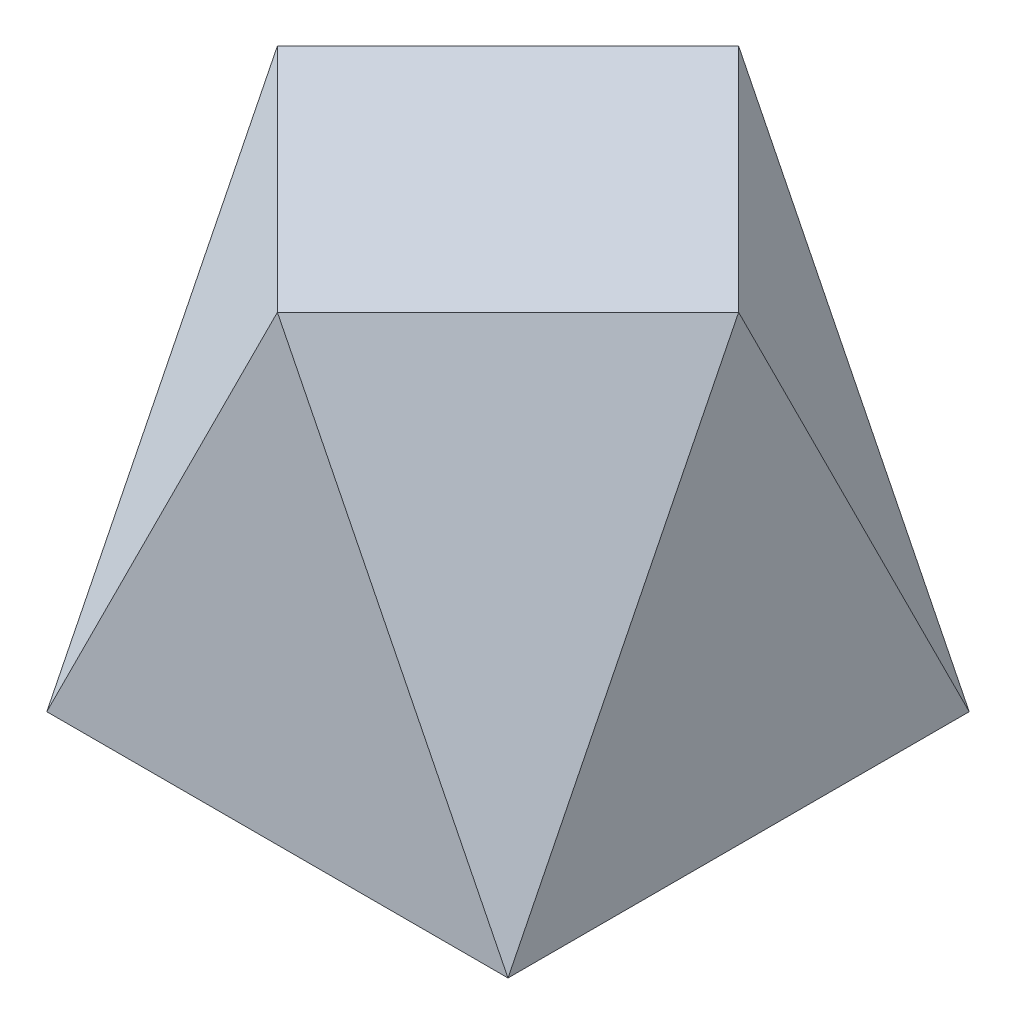
ISO-10303-21;
HEADER;
FILE_DESCRIPTION(('STEP AP214'),'2;1');
FILE_NAME('part.step','',(''),(''),'','','');
FILE_SCHEMA(('AUTOMOTIVE_DESIGN { 1 0 10303 214 1 1 1 1 }'));
ENDSEC;
DATA;
#1=APPLICATION_CONTEXT('core data for automotive mechanical design processes');
#2=APPLICATION_PROTOCOL_DEFINITION('international standard','automotive_design',2000,#1);
#3=PRODUCT_CONTEXT('',#1,'mechanical');
#4=PRODUCT('Part','Part','',(#3));
#5=PRODUCT_RELATED_PRODUCT_CATEGORY('part','',(#4));
#6=PRODUCT_DEFINITION_FORMATION('','',#4);
#7=PRODUCT_DEFINITION_CONTEXT('part definition',#1,'design');
#8=PRODUCT_DEFINITION('design','',#6,#7);
#9=PRODUCT_DEFINITION_SHAPE('','',#8);
#10=(LENGTH_UNIT() NAMED_UNIT(*) SI_UNIT(.MILLI.,.METRE.));
#11=(NAMED_UNIT(*) PLANE_ANGLE_UNIT() SI_UNIT($,.RADIAN.));
#12=(NAMED_UNIT(*) SI_UNIT($,.STERADIAN.) SOLID_ANGLE_UNIT());
#13=UNCERTAINTY_MEASURE_WITH_UNIT(LENGTH_MEASURE(1.E-05),#10,'distance_accuracy_value','');
#14=(GEOMETRIC_REPRESENTATION_CONTEXT(3) GLOBAL_UNCERTAINTY_ASSIGNED_CONTEXT((#13)) GLOBAL_UNIT_ASSIGNED_CONTEXT((#10,
#11,#12)) REPRESENTATION_CONTEXT('',''));
#15=CARTESIAN_POINT('',(0.,0.,0.));
#16=DIRECTION('',(0.,0.,1.));
#17=DIRECTION('',(1.,0.,0.));
#18=AXIS2_PLACEMENT_3D('',#15,#16,#17);
#19=CARTESIAN_POINT('',(-2.,4.,-2.));
#20=DIRECTION('',(0.,0.,1.));
#21=DIRECTION('',(1.,0.,0.));
#22=AXIS2_PLACEMENT_3D('',#19,#20,#21);
#23=PLANE('',#22);
#24=DIRECTION('',(-0.45428866888855,-0.890854536565577,0.));
#25=VECTOR('',#24,1.);
#26=CARTESIAN_POINT('',(0.,4.,-2.));
#27=LINE('',#26,#25);
#28=CARTESIAN_POINT('',(0.,4.,-2.));
#29=VERTEX_POINT('',#28);
#30=CARTESIAN_POINT('',(-2.,0.0780244035356792,-2.));
#31=VERTEX_POINT('',#30);
#32=EDGE_CURVE('E53',#29,#31,#27,.T.);
#33=ORIENTED_EDGE('',*,*,#32,.F.);
#34=DIRECTION('',(0.447213595499958,-0.894427190999916,0.));
#35=VECTOR('',#34,1.);
#36=CARTESIAN_POINT('',(0.,4.,-2.));
#37=LINE('',#36,#35);
#38=CARTESIAN_POINT('',(2.,0.,-2.));
#39=VERTEX_POINT('',#38);
#40=EDGE_CURVE('E94',#29,#39,#37,.T.);
#41=ORIENTED_EDGE('',*,*,#40,.T.);
#42=DIRECTION('',(-1.,0.,0.));
#43=VECTOR('',#42,1.);
#44=CARTESIAN_POINT('',(-2.,0.,-2.));
#45=LINE('',#44,#43);
#46=CARTESIAN_POINT('',(-2.,0.,-2.));
#47=VERTEX_POINT('',#46);
#48=EDGE_CURVE('E144',#39,#47,#45,.T.);
#49=ORIENTED_EDGE('',*,*,#48,.T.);
#50=DIRECTION('',(0.,-1.,0.));
#51=VECTOR('',#50,1.);
#52=CARTESIAN_POINT('',(-2.,4.,-2.));
#53=LINE('',#52,#51);
#54=EDGE_CURVE('E12',#31,#47,#53,.T.);
#55=ORIENTED_EDGE('',*,*,#54,.F.);
#56=EDGE_LOOP('',(#33,#41,#49,#55));
#57=FACE_BOUND('',#56,.T.);
#58=ADVANCED_FACE('F37',(#57),#23,.F.);
#59=CARTESIAN_POINT('',(0.,4.,0.));
#60=DIRECTION('',(0.,-1.,0.));
#61=DIRECTION('',(0.,0.,-1.));
#62=AXIS2_PLACEMENT_3D('',#59,#60,#61);
#63=PLANE('',#62);
#64=DIRECTION('',(0.707106781186547,0.,-0.707106781186548));
#65=VECTOR('',#64,1.);
#66=CARTESIAN_POINT('',(-2.,4.,0.));
#67=LINE('',#66,#65);
#68=CARTESIAN_POINT('',(-2.,4.,0.));
#69=VERTEX_POINT('',#68);
#70=EDGE_CURVE('E80',#69,#29,#67,.T.);
#71=ORIENTED_EDGE('',*,*,#70,.F.);
#72=DIRECTION('',(-0.707106781186548,0.,-0.707106781186548));
#73=VECTOR('',#72,1.);
#74=CARTESIAN_POINT('',(0.,4.,2.));
#75=LINE('',#74,#73);
#76=CARTESIAN_POINT('',(0.,4.,2.));
#77=VERTEX_POINT('',#76);
#78=EDGE_CURVE('E117',#77,#69,#75,.T.);
#79=ORIENTED_EDGE('',*,*,#78,.F.);
#80=DIRECTION('',(0.707106781186548,0.,-0.707106781186548));
#81=VECTOR('',#80,1.);
#82=CARTESIAN_POINT('',(0.,4.,2.));
#83=LINE('',#82,#81);
#84=CARTESIAN_POINT('',(2.,4.,0.));
#85=VERTEX_POINT('',#84);
#86=EDGE_CURVE('E101',#77,#85,#83,.T.);
#87=ORIENTED_EDGE('',*,*,#86,.T.);
#88=DIRECTION('',(-0.707106781186548,0.,-0.707106781186548));
#89=VECTOR('',#88,1.);
#90=CARTESIAN_POINT('',(2.,4.,0.));
#91=LINE('',#90,#89);
#92=EDGE_CURVE('E87',#85,#29,#91,.T.);
#93=ORIENTED_EDGE('',*,*,#92,.T.);
#94=EDGE_LOOP('',(#71,#79,#87,#93));
#95=FACE_BOUND('',#94,.T.);
#96=ADVANCED_FACE('F104',(#95),#63,.F.);
#97=CARTESIAN_POINT('',(-2.,4.,2.));
#98=DIRECTION('',(0.,0.,-1.));
#99=DIRECTION('',(-1.,0.,0.));
#100=AXIS2_PLACEMENT_3D('',#97,#98,#99);
#101=PLANE('',#100);
#102=DIRECTION('',(1.,0.,0.));
#103=VECTOR('',#102,1.);
#104=CARTESIAN_POINT('',(-2.,0.,2.));
#105=LINE('',#104,#103);
#106=CARTESIAN_POINT('',(-2.,0.,2.));
#107=VERTEX_POINT('',#106);
#108=CARTESIAN_POINT('',(2.,0.,2.));
#109=VERTEX_POINT('',#108);
#110=EDGE_CURVE('E46',#107,#109,#105,.T.);
#111=ORIENTED_EDGE('',*,*,#110,.T.);
#112=DIRECTION('',(0.447213595499958,-0.894427190999916,0.));
#113=VECTOR('',#112,1.);
#114=CARTESIAN_POINT('',(0.,4.,2.));
#115=LINE('',#114,#113);
#116=EDGE_CURVE('E61',#77,#109,#115,.T.);
#117=ORIENTED_EDGE('',*,*,#116,.F.);
#118=DIRECTION('',(0.447213595499958,0.894427190999916,0.));
#119=VECTOR('',#118,1.);
#120=CARTESIAN_POINT('',(-2.,0.,2.));
#121=LINE('',#120,#119);
#122=EDGE_CURVE('E128',#107,#77,#121,.T.);
#123=ORIENTED_EDGE('',*,*,#122,.F.);
#124=EDGE_LOOP('',(#111,#117,#123));
#125=FACE_BOUND('',#124,.T.);
#126=ADVANCED_FACE('F173',(#125),#101,.F.);
#127=CARTESIAN_POINT('',(2.,4.,2.));
#128=DIRECTION('',(-1.,0.,0.));
#129=DIRECTION('',(0.,0.,1.));
#130=AXIS2_PLACEMENT_3D('',#127,#128,#129);
#131=PLANE('',#130);
#132=DIRECTION('',(0.,0.,-1.));
#133=VECTOR('',#132,1.);
#134=CARTESIAN_POINT('',(2.,0.,2.));
#135=LINE('',#134,#133);
#136=EDGE_CURVE('E133',#109,#39,#135,.T.);
#137=ORIENTED_EDGE('',*,*,#136,.T.);
#138=DIRECTION('',(0.,0.894427190999916,0.447213595499958));
#139=VECTOR('',#138,1.);
#140=CARTESIAN_POINT('',(2.,0.,-2.));
#141=LINE('',#140,#139);
#142=EDGE_CURVE('E100',#39,#85,#141,.T.);
#143=ORIENTED_EDGE('',*,*,#142,.T.);
#144=DIRECTION('',(0.,0.894427190999916,-0.447213595499958));
#145=VECTOR('',#144,1.);
#146=CARTESIAN_POINT('',(2.,0.,2.));
#147=LINE('',#146,#145);
#148=EDGE_CURVE('E118',#109,#85,#147,.T.);
#149=ORIENTED_EDGE('',*,*,#148,.F.);
#150=EDGE_LOOP('',(#137,#143,#149));
#151=FACE_BOUND('',#150,.T.);
#152=ADVANCED_FACE('F39',(#151),#131,.F.);
#153=CARTESIAN_POINT('',(-2.,4.,2.));
#154=DIRECTION('',(1.,0.,0.));
#155=DIRECTION('',(0.,0.,-1.));
#156=AXIS2_PLACEMENT_3D('',#153,#154,#155);
#157=PLANE('',#156);
#158=DIRECTION('',(0.,-0.894427190999916,0.447213595499958));
#159=VECTOR('',#158,1.);
#160=CARTESIAN_POINT('',(-2.,4.,0.));
#161=LINE('',#160,#159);
#162=EDGE_CURVE('E131',#69,#107,#161,.T.);
#163=ORIENTED_EDGE('',*,*,#162,.F.);
#164=DIRECTION('',(0.,0.890854536565577,0.45428866888855));
#165=VECTOR('',#164,1.);
#166=CARTESIAN_POINT('',(-2.,0.0780244035356792,-2.));
#167=LINE('',#166,#165);
#168=EDGE_CURVE('E82',#31,#69,#167,.T.);
#169=ORIENTED_EDGE('',*,*,#168,.F.);
#170=ORIENTED_EDGE('',*,*,#54,.T.);
#171=DIRECTION('',(0.,0.,1.));
#172=VECTOR('',#171,1.);
#173=CARTESIAN_POINT('',(-2.,0.,2.));
#174=LINE('',#173,#172);
#175=EDGE_CURVE('E141',#47,#107,#174,.T.);
#176=ORIENTED_EDGE('',*,*,#175,.T.);
#177=EDGE_LOOP('',(#163,#169,#170,#176));
#178=FACE_BOUND('',#177,.T.);
#179=ADVANCED_FACE('F163',(#178),#157,.F.);
#180=CARTESIAN_POINT('',(0.,0.,0.));
#181=DIRECTION('',(0.,-1.,0.));
#182=DIRECTION('',(0.,0.,-1.));
#183=AXIS2_PLACEMENT_3D('',#180,#181,#182);
#184=PLANE('',#183);
#185=ORIENTED_EDGE('',*,*,#136,.F.);
#186=ORIENTED_EDGE('',*,*,#110,.F.);
#187=ORIENTED_EDGE('',*,*,#175,.F.);
#188=ORIENTED_EDGE('',*,*,#48,.F.);
#189=EDGE_LOOP('',(#185,#186,#187,#188));
#190=FACE_BOUND('',#189,.T.);
#191=ADVANCED_FACE('F160',(#190),#184,.T.);
#192=CARTESIAN_POINT('',(-1.77777777777778,0.888888888888889,1.77777777777778));
#193=DIRECTION('',(-0.666666666666666,0.333333333333333,0.666666666666667));
#194=DIRECTION('',(0.707106781186548,0.,0.707106781186547));
#195=AXIS2_PLACEMENT_3D('',#192,#193,#194);
#196=PLANE('',#195);
#197=ORIENTED_EDGE('',*,*,#78,.T.);
#198=ORIENTED_EDGE('',*,*,#162,.T.);
#199=ORIENTED_EDGE('',*,*,#122,.T.);
#200=EDGE_LOOP('',(#197,#198,#199));
#201=FACE_BOUND('',#200,.T.);
#202=ADVANCED_FACE('F171',(#201),#196,.T.);
#203=CARTESIAN_POINT('',(1.77777777777778,0.888888888888887,1.77777777777778));
#204=DIRECTION('',(-0.666666666666668,-0.333333333333333,-0.666666666666666));
#205=DIRECTION('',(-0.707106781186546,0.,0.707106781186549));
#206=AXIS2_PLACEMENT_3D('',#203,#204,#205);
#207=PLANE('',#206);
#208=ORIENTED_EDGE('',*,*,#116,.T.);
#209=ORIENTED_EDGE('',*,*,#148,.T.);
#210=ORIENTED_EDGE('',*,*,#86,.F.);
#211=EDGE_LOOP('',(#208,#209,#210));
#212=FACE_BOUND('',#211,.T.);
#213=ADVANCED_FACE('F175',(#212),#207,.F.);
#214=CARTESIAN_POINT('',(1.77777777777778,0.888888888888891,-1.77777777777778));
#215=DIRECTION('',(-0.666666666666666,-0.333333333333334,0.666666666666667));
#216=DIRECTION('',(0.707106781186548,0.,0.707106781186547));
#217=AXIS2_PLACEMENT_3D('',#214,#215,#216);
#218=PLANE('',#217);
#219=ORIENTED_EDGE('',*,*,#92,.F.);
#220=ORIENTED_EDGE('',*,*,#142,.F.);
#221=ORIENTED_EDGE('',*,*,#40,.F.);
#222=EDGE_LOOP('',(#219,#220,#221));
#223=FACE_BOUND('',#222,.T.);
#224=ADVANCED_FACE('F98',(#223),#218,.F.);
#225=CARTESIAN_POINT('',(-1.787480553308,0.911520487235782,-1.787480553308));
#226=DIRECTION('',(-0.665183332240754,0.339208297389927,-0.665183332240754));
#227=DIRECTION('',(-0.707106781186547,0.,0.707106781186547));
#228=AXIS2_PLACEMENT_3D('',#225,#226,#227);
#229=PLANE('',#228);
#230=ORIENTED_EDGE('',*,*,#168,.T.);
#231=ORIENTED_EDGE('',*,*,#70,.T.);
#232=ORIENTED_EDGE('',*,*,#32,.T.);
#233=EDGE_LOOP('',(#230,#231,#232));
#234=FACE_BOUND('',#233,.T.);
#235=ADVANCED_FACE('F81',(#234),#229,.T.);
#236=CLOSED_SHELL('',(#58,#96,#126,#152,#179,#191,#202,#213,#224,#235));
#237=MANIFOLD_SOLID_BREP('B2',#236);
#238=ADVANCED_BREP_SHAPE_REPRESENTATION('',(#18,#237),#14);
#239=SHAPE_DEFINITION_REPRESENTATION(#9,#238);
ENDSEC;
END-ISO-10303-21;
